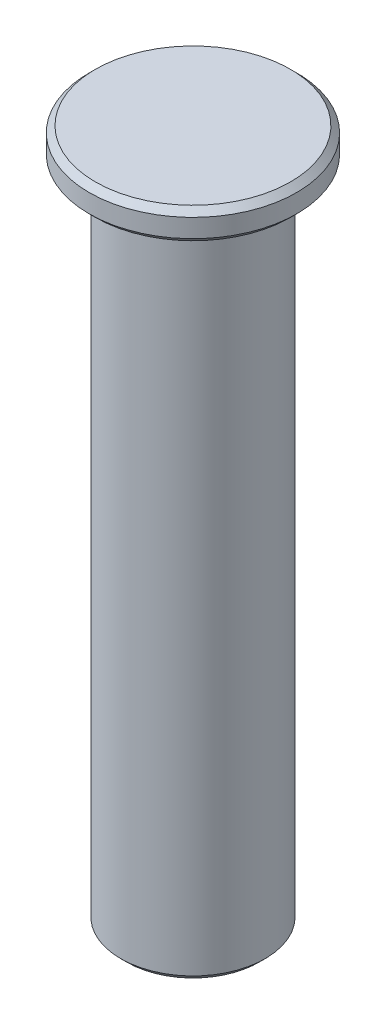
ISO-10303-21;
HEADER;
FILE_DESCRIPTION(('STEP AP214'),'2;1');
FILE_NAME('part.step','',(''),(''),'','','');
FILE_SCHEMA(('AUTOMOTIVE_DESIGN { 1 0 10303 214 1 1 1 1 }'));
ENDSEC;
DATA;
#1=APPLICATION_CONTEXT('core data for automotive mechanical design processes');
#2=APPLICATION_PROTOCOL_DEFINITION('international standard','automotive_design',2000,#1);
#3=PRODUCT_CONTEXT('',#1,'mechanical');
#4=PRODUCT('Part','Part','',(#3));
#5=PRODUCT_RELATED_PRODUCT_CATEGORY('part','',(#4));
#6=PRODUCT_DEFINITION_FORMATION('','',#4);
#7=PRODUCT_DEFINITION_CONTEXT('part definition',#1,'design');
#8=PRODUCT_DEFINITION('design','',#6,#7);
#9=PRODUCT_DEFINITION_SHAPE('','',#8);
#10=(LENGTH_UNIT() NAMED_UNIT(*) SI_UNIT(.MILLI.,.METRE.));
#11=(NAMED_UNIT(*) PLANE_ANGLE_UNIT() SI_UNIT($,.RADIAN.));
#12=(NAMED_UNIT(*) SI_UNIT($,.STERADIAN.) SOLID_ANGLE_UNIT());
#13=UNCERTAINTY_MEASURE_WITH_UNIT(LENGTH_MEASURE(1.E-05),#10,'distance_accuracy_value','');
#14=(GEOMETRIC_REPRESENTATION_CONTEXT(3) GLOBAL_UNCERTAINTY_ASSIGNED_CONTEXT((#13)) GLOBAL_UNIT_ASSIGNED_CONTEXT((#10,
#11,#12)) REPRESENTATION_CONTEXT('',''));
#15=CARTESIAN_POINT('',(0.,0.,0.));
#16=DIRECTION('',(0.,0.,1.));
#17=DIRECTION('',(1.,0.,0.));
#18=AXIS2_PLACEMENT_3D('',#15,#16,#17);
#19=CARTESIAN_POINT('',(0.,45.,0.));
#20=DIRECTION('',(0.,-1.,0.));
#21=DIRECTION('',(0.,0.,-1.));
#22=AXIS2_PLACEMENT_3D('',#19,#20,#21);
#23=CYLINDRICAL_SURFACE('',#22,4.7);
#24=CARTESIAN_POINT('',(0.,0.400000000000039,0.));
#25=DIRECTION('',(0.,1.,0.));
#26=DIRECTION('',(0.,0.,1.));
#27=AXIS2_PLACEMENT_3D('',#24,#25,#26);
#28=CIRCLE('',#27,4.7);
#29=CARTESIAN_POINT('',(0.,0.400000000000039,4.7));
#30=VERTEX_POINT('',#29);
#31=EDGE_CURVE('E41',#30,#30,#28,.T.);
#32=ORIENTED_EDGE('',*,*,#31,.T.);
#33=EDGE_LOOP('',(#32));
#34=FACE_BOUND('',#33,.T.);
#35=CARTESIAN_POINT('',(0.,43.,0.));
#36=DIRECTION('',(0.,1.,0.));
#37=DIRECTION('',(0.,0.,1.));
#38=AXIS2_PLACEMENT_3D('',#35,#36,#37);
#39=CIRCLE('',#38,4.7);
#40=CARTESIAN_POINT('',(0.,43.,4.7));
#41=VERTEX_POINT('',#40);
#42=EDGE_CURVE('E60',#41,#41,#39,.T.);
#43=ORIENTED_EDGE('',*,*,#42,.F.);
#44=EDGE_LOOP('',(#43));
#45=FACE_BOUND('',#44,.T.);
#46=ADVANCED_FACE('F34',(#34,#45),#23,.T.);
#47=CARTESIAN_POINT('',(0.,0.,0.));
#48=DIRECTION('',(0.,1.,0.));
#49=DIRECTION('',(0.,0.,1.));
#50=AXIS2_PLACEMENT_3D('',#47,#48,#49);
#51=PLANE('',#50);
#52=CARTESIAN_POINT('',(0.,0.,0.));
#53=DIRECTION('',(0.,1.,0.));
#54=DIRECTION('',(0.,0.,1.));
#55=AXIS2_PLACEMENT_3D('',#52,#53,#54);
#56=CIRCLE('',#55,4.29999999999996);
#57=CARTESIAN_POINT('',(0.,0.,4.29999999999996));
#58=VERTEX_POINT('',#57);
#59=EDGE_CURVE('E10',#58,#58,#56,.F.);
#60=ORIENTED_EDGE('',*,*,#59,.T.);
#61=EDGE_LOOP('',(#60));
#62=FACE_BOUND('',#61,.T.);
#63=ADVANCED_FACE('F67',(#62),#51,.F.);
#64=CARTESIAN_POINT('',(0.,43.,0.));
#65=DIRECTION('',(0.,1.,0.));
#66=DIRECTION('',(0.,0.,1.));
#67=AXIS2_PLACEMENT_3D('',#64,#65,#66);
#68=CYLINDRICAL_SURFACE('',#67,6.75);
#69=CARTESIAN_POINT('',(0.,43.4,0.));
#70=DIRECTION('',(0.,1.,0.));
#71=DIRECTION('',(0.,0.,1.));
#72=AXIS2_PLACEMENT_3D('',#69,#70,#71);
#73=CIRCLE('',#72,6.75);
#74=CARTESIAN_POINT('',(0.,43.4,6.75));
#75=VERTEX_POINT('',#74);
#76=EDGE_CURVE('E54',#75,#75,#73,.T.);
#77=ORIENTED_EDGE('',*,*,#76,.T.);
#78=EDGE_LOOP('',(#77));
#79=FACE_BOUND('',#78,.T.);
#80=CARTESIAN_POINT('',(0.,44.6,0.));
#81=DIRECTION('',(0.,1.,0.));
#82=DIRECTION('',(0.,0.,1.));
#83=AXIS2_PLACEMENT_3D('',#80,#81,#82);
#84=CIRCLE('',#83,6.75);
#85=CARTESIAN_POINT('',(0.,44.6,6.75));
#86=VERTEX_POINT('',#85);
#87=EDGE_CURVE('E57',#86,#86,#84,.F.);
#88=ORIENTED_EDGE('',*,*,#87,.T.);
#89=EDGE_LOOP('',(#88));
#90=FACE_BOUND('',#89,.T.);
#91=ADVANCED_FACE('F72',(#79,#90),#68,.T.);
#92=CARTESIAN_POINT('',(0.,43.,0.));
#93=DIRECTION('',(0.,1.,0.));
#94=DIRECTION('',(0.,0.,1.));
#95=AXIS2_PLACEMENT_3D('',#92,#93,#94);
#96=PLANE('',#95);
#97=CARTESIAN_POINT('',(0.,43.,0.));
#98=DIRECTION('',(0.,1.,0.));
#99=DIRECTION('',(0.,0.,1.));
#100=AXIS2_PLACEMENT_3D('',#97,#98,#99);
#101=CIRCLE('',#100,6.35);
#102=CARTESIAN_POINT('',(0.,43.,6.35));
#103=VERTEX_POINT('',#102);
#104=EDGE_CURVE('E49',#103,#103,#101,.F.);
#105=ORIENTED_EDGE('',*,*,#104,.T.);
#106=EDGE_LOOP('',(#105));
#107=FACE_BOUND('',#106,.T.);
#108=ORIENTED_EDGE('',*,*,#42,.T.);
#109=EDGE_LOOP('',(#108));
#110=FACE_BOUND('',#109,.T.);
#111=ADVANCED_FACE('F64',(#107,#110),#96,.F.);
#112=CARTESIAN_POINT('',(0.,45.,0.));
#113=DIRECTION('',(0.,1.,0.));
#114=DIRECTION('',(0.,0.,1.));
#115=AXIS2_PLACEMENT_3D('',#112,#113,#114);
#116=PLANE('',#115);
#117=CARTESIAN_POINT('',(0.,45.,0.));
#118=DIRECTION('',(0.,1.,0.));
#119=DIRECTION('',(0.,0.,1.));
#120=AXIS2_PLACEMENT_3D('',#117,#118,#119);
#121=CIRCLE('',#120,6.35000000000001);
#122=CARTESIAN_POINT('',(0.,45.,6.35000000000001));
#123=VERTEX_POINT('',#122);
#124=EDGE_CURVE('E45',#123,#123,#121,.T.);
#125=ORIENTED_EDGE('',*,*,#124,.T.);
#126=EDGE_LOOP('',(#125));
#127=FACE_BOUND('',#126,.T.);
#128=ADVANCED_FACE('F79',(#127),#116,.T.);
#129=CARTESIAN_POINT('',(0.,43.4,0.));
#130=DIRECTION('',(0.,1.,0.));
#131=DIRECTION('',(0.,0.,1.));
#132=AXIS2_PLACEMENT_3D('',#129,#130,#131);
#133=CONICAL_SURFACE('',#132,6.75,0.785398163397442);
#134=ORIENTED_EDGE('',*,*,#104,.F.);
#135=EDGE_LOOP('',(#134));
#136=FACE_BOUND('',#135,.T.);
#137=ORIENTED_EDGE('',*,*,#76,.F.);
#138=EDGE_LOOP('',(#137));
#139=FACE_BOUND('',#138,.T.);
#140=ADVANCED_FACE('F76',(#136,#139),#133,.T.);
#141=CARTESIAN_POINT('',(0.,45.,0.));
#142=DIRECTION('',(0.,-1.,0.));
#143=DIRECTION('',(0.,0.,-1.));
#144=AXIS2_PLACEMENT_3D('',#141,#142,#143);
#145=CONICAL_SURFACE('',#144,6.35000000000001,0.785398163397449);
#146=ORIENTED_EDGE('',*,*,#87,.F.);
#147=EDGE_LOOP('',(#146));
#148=FACE_BOUND('',#147,.T.);
#149=ORIENTED_EDGE('',*,*,#124,.F.);
#150=EDGE_LOOP('',(#149));
#151=FACE_BOUND('',#150,.T.);
#152=ADVANCED_FACE('F78',(#148,#151),#145,.T.);
#153=CARTESIAN_POINT('',(0.,0.400000000000039,0.));
#154=DIRECTION('',(0.,1.,0.));
#155=DIRECTION('',(0.,0.,1.));
#156=AXIS2_PLACEMENT_3D('',#153,#154,#155);
#157=CONICAL_SURFACE('',#156,4.7,0.785398163397449);
#158=ORIENTED_EDGE('',*,*,#59,.F.);
#159=EDGE_LOOP('',(#158));
#160=FACE_BOUND('',#159,.T.);
#161=ORIENTED_EDGE('',*,*,#31,.F.);
#162=EDGE_LOOP('',(#161));
#163=FACE_BOUND('',#162,.T.);
#164=ADVANCED_FACE('F36',(#160,#163),#157,.T.);
#165=CLOSED_SHELL('',(#46,#63,#91,#111,#128,#140,#152,#164));
#166=MANIFOLD_SOLID_BREP('B2',#165);
#167=ADVANCED_BREP_SHAPE_REPRESENTATION('',(#18,#166),#14);
#168=SHAPE_DEFINITION_REPRESENTATION(#9,#167);
ENDSEC;
END-ISO-10303-21;
